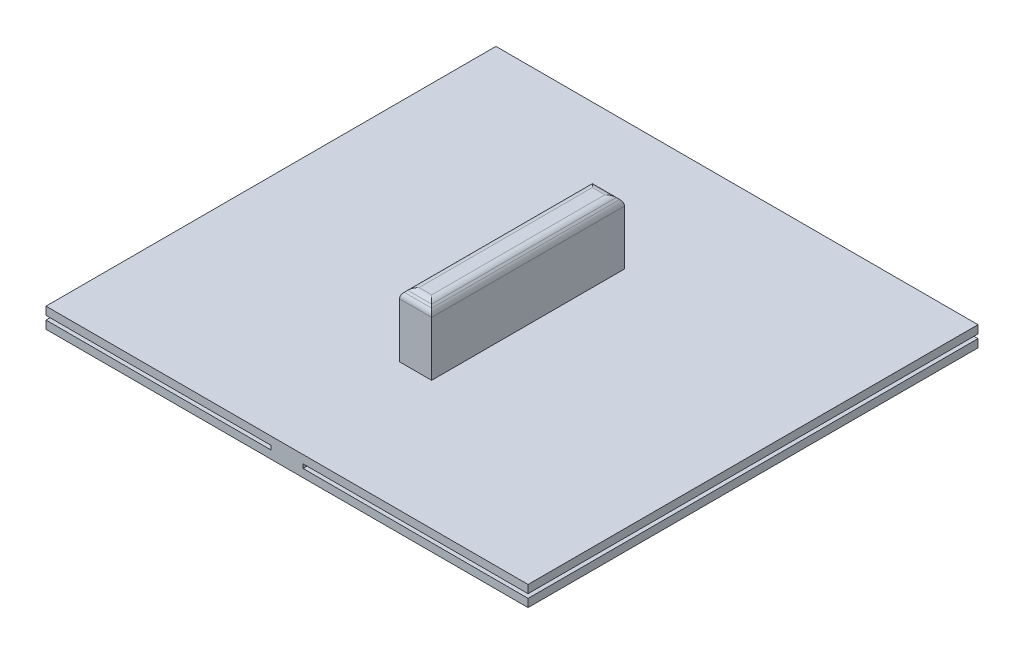
ISO-10303-21;
HEADER;
FILE_DESCRIPTION(('STEP AP214'),'2;1');
FILE_NAME('part.step','',(''),(''),'','','');
FILE_SCHEMA(('AUTOMOTIVE_DESIGN { 1 0 10303 214 1 1 1 1 }'));
ENDSEC;
DATA;
#1=APPLICATION_CONTEXT('core data for automotive mechanical design processes');
#2=APPLICATION_PROTOCOL_DEFINITION('international standard','automotive_design',2000,#1);
#3=PRODUCT_CONTEXT('',#1,'mechanical');
#4=PRODUCT('Part','Part','',(#3));
#5=PRODUCT_RELATED_PRODUCT_CATEGORY('part','',(#4));
#6=PRODUCT_DEFINITION_FORMATION('','',#4);
#7=PRODUCT_DEFINITION_CONTEXT('part definition',#1,'design');
#8=PRODUCT_DEFINITION('design','',#6,#7);
#9=PRODUCT_DEFINITION_SHAPE('','',#8);
#10=(LENGTH_UNIT() NAMED_UNIT(*) SI_UNIT(.MILLI.,.METRE.));
#11=(NAMED_UNIT(*) PLANE_ANGLE_UNIT() SI_UNIT($,.RADIAN.));
#12=(NAMED_UNIT(*) SI_UNIT($,.STERADIAN.) SOLID_ANGLE_UNIT());
#13=UNCERTAINTY_MEASURE_WITH_UNIT(LENGTH_MEASURE(1.E-05),#10,'distance_accuracy_value','');
#14=(GEOMETRIC_REPRESENTATION_CONTEXT(3) GLOBAL_UNCERTAINTY_ASSIGNED_CONTEXT((#13)) GLOBAL_UNIT_ASSIGNED_CONTEXT((#10,
#11,#12)) REPRESENTATION_CONTEXT('',''));
#15=CARTESIAN_POINT('',(0.,0.,0.));
#16=DIRECTION('',(0.,0.,1.));
#17=DIRECTION('',(1.,0.,0.));
#18=AXIS2_PLACEMENT_3D('',#15,#16,#17);
#19=CARTESIAN_POINT('',(-1.27,5.3975,-35.56));
#20=DIRECTION('',(-1.,0.,0.));
#21=DIRECTION('',(0.,-1.,0.));
#22=AXIS2_PLACEMENT_3D('',#19,#20,#21);
#23=PLANE('',#22);
#24=DIRECTION('',(0.,-1.,0.));
#25=VECTOR('',#24,1.);
#26=CARTESIAN_POINT('',(-1.27,5.3975,-10.16));
#27=LINE('',#26,#25);
#28=CARTESIAN_POINT('',(-1.27,4.62647438789308,-10.16));
#29=VERTEX_POINT('',#28);
#30=CARTESIAN_POINT('',(-1.27,0.3175,-10.16));
#31=VERTEX_POINT('',#30);
#32=EDGE_CURVE('E526',#29,#31,#27,.T.);
#33=ORIENTED_EDGE('',*,*,#32,.F.);
#34=DIRECTION('',(0.,0.,1.));
#35=VECTOR('',#34,1.);
#36=CARTESIAN_POINT('',(-1.27,4.62647438789308,-35.56));
#37=LINE('',#36,#35);
#38=CARTESIAN_POINT('',(-1.27,4.62647438789308,-25.4));
#39=VERTEX_POINT('',#38);
#40=EDGE_CURVE('E43',#29,#39,#37,.F.);
#41=ORIENTED_EDGE('',*,*,#40,.T.);
#42=DIRECTION('',(0.,1.,0.));
#43=VECTOR('',#42,1.);
#44=CARTESIAN_POINT('',(-1.27,0.3175,-25.4));
#45=LINE('',#44,#43);
#46=CARTESIAN_POINT('',(-1.27,0.3175,-25.4));
#47=VERTEX_POINT('',#46);
#48=EDGE_CURVE('E204',#47,#39,#45,.T.);
#49=ORIENTED_EDGE('',*,*,#48,.F.);
#50=DIRECTION('',(0.,0.,1.));
#51=VECTOR('',#50,1.);
#52=CARTESIAN_POINT('',(-1.27,0.3175,-35.56));
#53=LINE('',#52,#51);
#54=EDGE_CURVE('E203',#47,#31,#53,.T.);
#55=ORIENTED_EDGE('',*,*,#54,.T.);
#56=EDGE_LOOP('',(#33,#41,#49,#55));
#57=FACE_BOUND('',#56,.T.);
#58=ADVANCED_FACE('F34',(#57),#23,.T.);
#59=CARTESIAN_POINT('',(-1.27,5.3975,-35.56));
#60=DIRECTION('',(0.,1.,0.));
#61=DIRECTION('',(0.,0.,1.));
#62=AXIS2_PLACEMENT_3D('',#59,#60,#61);
#63=PLANE('',#62);
#64=DIRECTION('',(-1.,0.,0.));
#65=VECTOR('',#64,1.);
#66=CARTESIAN_POINT('',(-1.27,5.3975,-24.6289743878931));
#67=LINE('',#66,#65);
#68=CARTESIAN_POINT('',(0.49897438789308,5.3975,-24.6289743878931));
#69=VERTEX_POINT('',#68);
#70=CARTESIAN_POINT('',(-0.498974387893082,5.3975,-24.6289743878931));
#71=VERTEX_POINT('',#70);
#72=EDGE_CURVE('E234',#69,#71,#67,.T.);
#73=ORIENTED_EDGE('',*,*,#72,.T.);
#74=DIRECTION('',(0.,0.,-1.));
#75=VECTOR('',#74,1.);
#76=CARTESIAN_POINT('',(-0.498974387893082,5.3975,-35.56));
#77=LINE('',#76,#75);
#78=CARTESIAN_POINT('',(-0.498974387893082,5.3975,-10.9310256121069));
#79=VERTEX_POINT('',#78);
#80=EDGE_CURVE('E236',#71,#79,#77,.F.);
#81=ORIENTED_EDGE('',*,*,#80,.T.);
#82=DIRECTION('',(-1.,0.,0.));
#83=VECTOR('',#82,1.);
#84=CARTESIAN_POINT('',(-1.27,5.3975,-10.9310256121069));
#85=LINE('',#84,#83);
#86=CARTESIAN_POINT('',(0.49897438789308,5.3975,-10.9310256121069));
#87=VERTEX_POINT('',#86);
#88=EDGE_CURVE('E229',#79,#87,#85,.F.);
#89=ORIENTED_EDGE('',*,*,#88,.T.);
#90=DIRECTION('',(0.,0.,1.));
#91=VECTOR('',#90,1.);
#92=CARTESIAN_POINT('',(0.49897438789308,5.3975,-35.56));
#93=LINE('',#92,#91);
#94=EDGE_CURVE('E231',#87,#69,#93,.F.);
#95=ORIENTED_EDGE('',*,*,#94,.T.);
#96=EDGE_LOOP('',(#73,#81,#89,#95));
#97=FACE_BOUND('',#96,.T.);
#98=ADVANCED_FACE('F307',(#97),#63,.T.);
#99=CARTESIAN_POINT('',(1.27,0.3175,-35.56));
#100=DIRECTION('',(1.,0.,0.));
#101=DIRECTION('',(0.,1.,0.));
#102=AXIS2_PLACEMENT_3D('',#99,#100,#101);
#103=PLANE('',#102);
#104=DIRECTION('',(0.,-1.,0.));
#105=VECTOR('',#104,1.);
#106=CARTESIAN_POINT('',(1.27,0.3175,-25.4));
#107=LINE('',#106,#105);
#108=CARTESIAN_POINT('',(1.27,4.62647438789308,-25.4));
#109=VERTEX_POINT('',#108);
#110=CARTESIAN_POINT('',(1.27,0.3175,-25.4));
#111=VERTEX_POINT('',#110);
#112=EDGE_CURVE('E184',#109,#111,#107,.T.);
#113=ORIENTED_EDGE('',*,*,#112,.F.);
#114=DIRECTION('',(0.,0.,-1.));
#115=VECTOR('',#114,1.);
#116=CARTESIAN_POINT('',(1.27,4.62647438789308,-35.56));
#117=LINE('',#116,#115);
#118=CARTESIAN_POINT('',(1.27,4.62647438789308,-10.16));
#119=VERTEX_POINT('',#118);
#120=EDGE_CURVE('E11',#109,#119,#117,.F.);
#121=ORIENTED_EDGE('',*,*,#120,.T.);
#122=DIRECTION('',(0.,1.,0.));
#123=VECTOR('',#122,1.);
#124=CARTESIAN_POINT('',(1.27,5.3975,-10.16));
#125=LINE('',#124,#123);
#126=CARTESIAN_POINT('',(1.27,0.3175,-10.16));
#127=VERTEX_POINT('',#126);
#128=EDGE_CURVE('E207',#127,#119,#125,.T.);
#129=ORIENTED_EDGE('',*,*,#128,.F.);
#130=DIRECTION('',(0.,0.,1.));
#131=VECTOR('',#130,1.);
#132=CARTESIAN_POINT('',(1.27,0.3175,-35.56));
#133=LINE('',#132,#131);
#134=EDGE_CURVE('E200',#111,#127,#133,.T.);
#135=ORIENTED_EDGE('',*,*,#134,.F.);
#136=EDGE_LOOP('',(#113,#121,#129,#135));
#137=FACE_BOUND('',#136,.T.);
#138=ADVANCED_FACE('F206',(#137),#103,.T.);
#139=CARTESIAN_POINT('',(19.05,-0.3175,-35.56));
#140=DIRECTION('',(1.,0.,0.));
#141=DIRECTION('',(0.,0.,-1.));
#142=AXIS2_PLACEMENT_3D('',#139,#140,#141);
#143=PLANE('',#142);
#144=DIRECTION('',(0.,1.,0.));
#145=VECTOR('',#144,1.);
#146=CARTESIAN_POINT('',(19.05,-0.3175,0.));
#147=LINE('',#146,#145);
#148=CARTESIAN_POINT('',(19.05,-0.3175,0.));
#149=VERTEX_POINT('',#148);
#150=CARTESIAN_POINT('',(19.05,0.3175,0.));
#151=VERTEX_POINT('',#150);
#152=EDGE_CURVE('E425',#149,#151,#147,.T.);
#153=ORIENTED_EDGE('',*,*,#152,.F.);
#154=DIRECTION('',(0.,0.,1.));
#155=VECTOR('',#154,1.);
#156=CARTESIAN_POINT('',(19.05,-0.3175,-35.56));
#157=LINE('',#156,#155);
#158=CARTESIAN_POINT('',(19.05,-0.3175,-35.56));
#159=VERTEX_POINT('',#158);
#160=EDGE_CURVE('E459',#159,#149,#157,.T.);
#161=ORIENTED_EDGE('',*,*,#160,.F.);
#162=DIRECTION('',(0.,1.,0.));
#163=VECTOR('',#162,1.);
#164=CARTESIAN_POINT('',(19.05,-0.3175,-35.56));
#165=LINE('',#164,#163);
#166=CARTESIAN_POINT('',(19.05,0.3175,-35.56));
#167=VERTEX_POINT('',#166);
#168=EDGE_CURVE('E208',#159,#167,#165,.T.);
#169=ORIENTED_EDGE('',*,*,#168,.T.);
#170=DIRECTION('',(0.,0.,1.));
#171=VECTOR('',#170,1.);
#172=CARTESIAN_POINT('',(19.05,0.3175,-35.56));
#173=LINE('',#172,#171);
#174=EDGE_CURVE('E232',#167,#151,#173,.T.);
#175=ORIENTED_EDGE('',*,*,#174,.T.);
#176=EDGE_LOOP('',(#153,#161,#169,#175));
#177=FACE_BOUND('',#176,.T.);
#178=ADVANCED_FACE('F338',(#177),#143,.T.);
#179=CARTESIAN_POINT('',(1.27,-0.3175,-35.56));
#180=DIRECTION('',(0.,-1.,0.));
#181=DIRECTION('',(0.,0.,-1.));
#182=AXIS2_PLACEMENT_3D('',#179,#180,#181);
#183=PLANE('',#182);
#184=DIRECTION('',(1.,0.,0.));
#185=VECTOR('',#184,1.);
#186=CARTESIAN_POINT('',(1.27,-0.3175,0.));
#187=LINE('',#186,#185);
#188=CARTESIAN_POINT('',(1.27,-0.3175,0.));
#189=VERTEX_POINT('',#188);
#190=EDGE_CURVE('E454',#189,#149,#187,.T.);
#191=ORIENTED_EDGE('',*,*,#190,.F.);
#192=DIRECTION('',(0.,0.,1.));
#193=VECTOR('',#192,1.);
#194=CARTESIAN_POINT('',(1.27,-0.3175,-35.56));
#195=LINE('',#194,#193);
#196=CARTESIAN_POINT('',(1.27,-0.3175,-35.56));
#197=VERTEX_POINT('',#196);
#198=EDGE_CURVE('E461',#197,#189,#195,.T.);
#199=ORIENTED_EDGE('',*,*,#198,.F.);
#200=DIRECTION('',(1.,0.,0.));
#201=VECTOR('',#200,1.);
#202=CARTESIAN_POINT('',(1.27,-0.3175,-35.56));
#203=LINE('',#202,#201);
#204=EDGE_CURVE('E213',#197,#159,#203,.T.);
#205=ORIENTED_EDGE('',*,*,#204,.T.);
#206=ORIENTED_EDGE('',*,*,#160,.T.);
#207=EDGE_LOOP('',(#191,#199,#205,#206));
#208=FACE_BOUND('',#207,.T.);
#209=ADVANCED_FACE('F367',(#208),#183,.T.);
#210=CARTESIAN_POINT('',(1.27,-0.635,-35.56));
#211=DIRECTION('',(1.,0.,0.));
#212=DIRECTION('',(0.,1.,0.));
#213=AXIS2_PLACEMENT_3D('',#210,#211,#212);
#214=PLANE('',#213);
#215=DIRECTION('',(0.,1.,0.));
#216=VECTOR('',#215,1.);
#217=CARTESIAN_POINT('',(1.27,-0.635,0.));
#218=LINE('',#217,#216);
#219=CARTESIAN_POINT('',(1.27,-0.635,0.));
#220=VERTEX_POINT('',#219);
#221=EDGE_CURVE('E451',#220,#189,#218,.T.);
#222=ORIENTED_EDGE('',*,*,#221,.F.);
#223=DIRECTION('',(0.,0.,1.));
#224=VECTOR('',#223,1.);
#225=CARTESIAN_POINT('',(1.27,-0.635,-35.56));
#226=LINE('',#225,#224);
#227=CARTESIAN_POINT('',(1.27,-0.635,-35.56));
#228=VERTEX_POINT('',#227);
#229=EDGE_CURVE('E463',#228,#220,#226,.T.);
#230=ORIENTED_EDGE('',*,*,#229,.F.);
#231=DIRECTION('',(0.,1.,0.));
#232=VECTOR('',#231,1.);
#233=CARTESIAN_POINT('',(1.27,-0.635,-35.56));
#234=LINE('',#233,#232);
#235=EDGE_CURVE('E505',#228,#197,#234,.T.);
#236=ORIENTED_EDGE('',*,*,#235,.T.);
#237=ORIENTED_EDGE('',*,*,#198,.T.);
#238=EDGE_LOOP('',(#222,#230,#236,#237));
#239=FACE_BOUND('',#238,.T.);
#240=ADVANCED_FACE('F371',(#239),#214,.T.);
#241=CARTESIAN_POINT('',(1.27,-0.635,-35.56));
#242=DIRECTION('',(0.,1.,0.));
#243=DIRECTION('',(0.,0.,1.));
#244=AXIS2_PLACEMENT_3D('',#241,#242,#243);
#245=PLANE('',#244);
#246=DIRECTION('',(-1.,0.,0.));
#247=VECTOR('',#246,1.);
#248=CARTESIAN_POINT('',(1.27,-0.635,0.));
#249=LINE('',#248,#247);
#250=CARTESIAN_POINT('',(19.05,-0.635,0.));
#251=VERTEX_POINT('',#250);
#252=EDGE_CURVE('E448',#251,#220,#249,.T.);
#253=ORIENTED_EDGE('',*,*,#252,.F.);
#254=DIRECTION('',(0.,0.,1.));
#255=VECTOR('',#254,1.);
#256=CARTESIAN_POINT('',(19.05,-0.635,-35.56));
#257=LINE('',#256,#255);
#258=CARTESIAN_POINT('',(19.05,-0.635,-35.56));
#259=VERTEX_POINT('',#258);
#260=EDGE_CURVE('E465',#259,#251,#257,.T.);
#261=ORIENTED_EDGE('',*,*,#260,.F.);
#262=DIRECTION('',(-1.,0.,0.));
#263=VECTOR('',#262,1.);
#264=CARTESIAN_POINT('',(1.27,-0.635,-35.56));
#265=LINE('',#264,#263);
#266=EDGE_CURVE('E502',#259,#228,#265,.T.);
#267=ORIENTED_EDGE('',*,*,#266,.T.);
#268=ORIENTED_EDGE('',*,*,#229,.T.);
#269=EDGE_LOOP('',(#253,#261,#267,#268));
#270=FACE_BOUND('',#269,.T.);
#271=ADVANCED_FACE('F375',(#270),#245,.T.);
#272=CARTESIAN_POINT('',(19.05,-1.27,-35.56));
#273=DIRECTION('',(1.,0.,0.));
#274=DIRECTION('',(0.,0.,-1.));
#275=AXIS2_PLACEMENT_3D('',#272,#273,#274);
#276=PLANE('',#275);
#277=DIRECTION('',(0.,1.,0.));
#278=VECTOR('',#277,1.);
#279=CARTESIAN_POINT('',(19.05,-1.27,0.));
#280=LINE('',#279,#278);
#281=CARTESIAN_POINT('',(19.05,-1.27,0.));
#282=VERTEX_POINT('',#281);
#283=EDGE_CURVE('E445',#282,#251,#280,.T.);
#284=ORIENTED_EDGE('',*,*,#283,.F.);
#285=DIRECTION('',(0.,0.,1.));
#286=VECTOR('',#285,1.);
#287=CARTESIAN_POINT('',(19.05,-1.27,-35.56));
#288=LINE('',#287,#286);
#289=CARTESIAN_POINT('',(19.05,-1.27,-35.56));
#290=VERTEX_POINT('',#289);
#291=EDGE_CURVE('E467',#290,#282,#288,.T.);
#292=ORIENTED_EDGE('',*,*,#291,.F.);
#293=DIRECTION('',(0.,1.,0.));
#294=VECTOR('',#293,1.);
#295=CARTESIAN_POINT('',(19.05,-1.27,-35.56));
#296=LINE('',#295,#294);
#297=EDGE_CURVE('E499',#290,#259,#296,.T.);
#298=ORIENTED_EDGE('',*,*,#297,.T.);
#299=ORIENTED_EDGE('',*,*,#260,.T.);
#300=EDGE_LOOP('',(#284,#292,#298,#299));
#301=FACE_BOUND('',#300,.T.);
#302=ADVANCED_FACE('F379',(#301),#276,.T.);
#303=CARTESIAN_POINT('',(-19.05,-1.27,-35.56));
#304=DIRECTION('',(0.,-1.,0.));
#305=DIRECTION('',(0.,0.,-1.));
#306=AXIS2_PLACEMENT_3D('',#303,#304,#305);
#307=PLANE('',#306);
#308=DIRECTION('',(1.,0.,0.));
#309=VECTOR('',#308,1.);
#310=CARTESIAN_POINT('',(-19.05,-1.27,0.));
#311=LINE('',#310,#309);
#312=CARTESIAN_POINT('',(-19.05,-1.27,0.));
#313=VERTEX_POINT('',#312);
#314=EDGE_CURVE('E442',#313,#282,#311,.T.);
#315=ORIENTED_EDGE('',*,*,#314,.F.);
#316=DIRECTION('',(0.,0.,1.));
#317=VECTOR('',#316,1.);
#318=CARTESIAN_POINT('',(-19.05,-1.27,-35.56));
#319=LINE('',#318,#317);
#320=CARTESIAN_POINT('',(-19.05,-1.27,-35.56));
#321=VERTEX_POINT('',#320);
#322=EDGE_CURVE('E469',#321,#313,#319,.T.);
#323=ORIENTED_EDGE('',*,*,#322,.F.);
#324=DIRECTION('',(1.,0.,0.));
#325=VECTOR('',#324,1.);
#326=CARTESIAN_POINT('',(-19.05,-1.27,-35.56));
#327=LINE('',#326,#325);
#328=EDGE_CURVE('E496',#321,#290,#327,.T.);
#329=ORIENTED_EDGE('',*,*,#328,.T.);
#330=ORIENTED_EDGE('',*,*,#291,.T.);
#331=EDGE_LOOP('',(#315,#323,#329,#330));
#332=FACE_BOUND('',#331,.T.);
#333=ADVANCED_FACE('F383',(#332),#307,.T.);
#334=CARTESIAN_POINT('',(-19.05,-1.27,-35.56));
#335=DIRECTION('',(-1.,0.,0.));
#336=DIRECTION('',(0.,0.,1.));
#337=AXIS2_PLACEMENT_3D('',#334,#335,#336);
#338=PLANE('',#337);
#339=DIRECTION('',(0.,-1.,0.));
#340=VECTOR('',#339,1.);
#341=CARTESIAN_POINT('',(-19.05,-1.27,0.));
#342=LINE('',#341,#340);
#343=CARTESIAN_POINT('',(-19.05,-0.635,0.));
#344=VERTEX_POINT('',#343);
#345=EDGE_CURVE('E439',#344,#313,#342,.T.);
#346=ORIENTED_EDGE('',*,*,#345,.F.);
#347=DIRECTION('',(0.,0.,1.));
#348=VECTOR('',#347,1.);
#349=CARTESIAN_POINT('',(-19.05,-0.635,-35.56));
#350=LINE('',#349,#348);
#351=CARTESIAN_POINT('',(-19.05,-0.635,-35.56));
#352=VERTEX_POINT('',#351);
#353=EDGE_CURVE('E471',#352,#344,#350,.T.);
#354=ORIENTED_EDGE('',*,*,#353,.F.);
#355=DIRECTION('',(0.,-1.,0.));
#356=VECTOR('',#355,1.);
#357=CARTESIAN_POINT('',(-19.05,-1.27,-35.56));
#358=LINE('',#357,#356);
#359=EDGE_CURVE('E493',#352,#321,#358,.T.);
#360=ORIENTED_EDGE('',*,*,#359,.T.);
#361=ORIENTED_EDGE('',*,*,#322,.T.);
#362=EDGE_LOOP('',(#346,#354,#360,#361));
#363=FACE_BOUND('',#362,.T.);
#364=ADVANCED_FACE('F387',(#363),#338,.T.);
#365=CARTESIAN_POINT('',(-19.05,-0.635,-35.56));
#366=DIRECTION('',(0.,1.,0.));
#367=DIRECTION('',(0.,0.,1.));
#368=AXIS2_PLACEMENT_3D('',#365,#366,#367);
#369=PLANE('',#368);
#370=DIRECTION('',(-1.,0.,0.));
#371=VECTOR('',#370,1.);
#372=CARTESIAN_POINT('',(-19.05,-0.635,0.));
#373=LINE('',#372,#371);
#374=CARTESIAN_POINT('',(-1.27,-0.635,0.));
#375=VERTEX_POINT('',#374);
#376=EDGE_CURVE('E436',#375,#344,#373,.T.);
#377=ORIENTED_EDGE('',*,*,#376,.F.);
#378=DIRECTION('',(0.,0.,1.));
#379=VECTOR('',#378,1.);
#380=CARTESIAN_POINT('',(-1.27,-0.635,-35.56));
#381=LINE('',#380,#379);
#382=CARTESIAN_POINT('',(-1.27,-0.635,-35.56));
#383=VERTEX_POINT('',#382);
#384=EDGE_CURVE('E473',#383,#375,#381,.T.);
#385=ORIENTED_EDGE('',*,*,#384,.F.);
#386=DIRECTION('',(-1.,0.,0.));
#387=VECTOR('',#386,1.);
#388=CARTESIAN_POINT('',(-19.05,-0.635,-35.56));
#389=LINE('',#388,#387);
#390=EDGE_CURVE('E490',#383,#352,#389,.T.);
#391=ORIENTED_EDGE('',*,*,#390,.T.);
#392=ORIENTED_EDGE('',*,*,#353,.T.);
#393=EDGE_LOOP('',(#377,#385,#391,#392));
#394=FACE_BOUND('',#393,.T.);
#395=ADVANCED_FACE('F391',(#394),#369,.T.);
#396=CARTESIAN_POINT('',(-1.27,-0.635,-35.56));
#397=DIRECTION('',(-1.,0.,0.));
#398=DIRECTION('',(0.,-1.,0.));
#399=AXIS2_PLACEMENT_3D('',#396,#397,#398);
#400=PLANE('',#399);
#401=DIRECTION('',(0.,-1.,0.));
#402=VECTOR('',#401,1.);
#403=CARTESIAN_POINT('',(-1.27,-0.635,0.));
#404=LINE('',#403,#402);
#405=CARTESIAN_POINT('',(-1.27,-0.3175,0.));
#406=VERTEX_POINT('',#405);
#407=EDGE_CURVE('E433',#406,#375,#404,.T.);
#408=ORIENTED_EDGE('',*,*,#407,.F.);
#409=DIRECTION('',(0.,0.,1.));
#410=VECTOR('',#409,1.);
#411=CARTESIAN_POINT('',(-1.27,-0.3175,-35.56));
#412=LINE('',#411,#410);
#413=CARTESIAN_POINT('',(-1.27,-0.3175,-35.56));
#414=VERTEX_POINT('',#413);
#415=EDGE_CURVE('E475',#414,#406,#412,.T.);
#416=ORIENTED_EDGE('',*,*,#415,.F.);
#417=DIRECTION('',(0.,-1.,0.));
#418=VECTOR('',#417,1.);
#419=CARTESIAN_POINT('',(-1.27,-0.635,-35.56));
#420=LINE('',#419,#418);
#421=EDGE_CURVE('E487',#414,#383,#420,.T.);
#422=ORIENTED_EDGE('',*,*,#421,.T.);
#423=ORIENTED_EDGE('',*,*,#384,.T.);
#424=EDGE_LOOP('',(#408,#416,#422,#423));
#425=FACE_BOUND('',#424,.T.);
#426=ADVANCED_FACE('F395',(#425),#400,.T.);
#427=CARTESIAN_POINT('',(-1.27,-0.3175,-35.56));
#428=DIRECTION('',(0.,-1.,0.));
#429=DIRECTION('',(0.,0.,-1.));
#430=AXIS2_PLACEMENT_3D('',#427,#428,#429);
#431=PLANE('',#430);
#432=DIRECTION('',(1.,0.,0.));
#433=VECTOR('',#432,1.);
#434=CARTESIAN_POINT('',(-1.27,-0.3175,0.));
#435=LINE('',#434,#433);
#436=CARTESIAN_POINT('',(-19.05,-0.3175,0.));
#437=VERTEX_POINT('',#436);
#438=EDGE_CURVE('E419',#437,#406,#435,.T.);
#439=ORIENTED_EDGE('',*,*,#438,.F.);
#440=DIRECTION('',(0.,0.,1.));
#441=VECTOR('',#440,1.);
#442=CARTESIAN_POINT('',(-19.05,-0.3175,-35.56));
#443=LINE('',#442,#441);
#444=CARTESIAN_POINT('',(-19.05,-0.3175,-35.56));
#445=VERTEX_POINT('',#444);
#446=EDGE_CURVE('E416',#445,#437,#443,.T.);
#447=ORIENTED_EDGE('',*,*,#446,.F.);
#448=DIRECTION('',(1.,0.,0.));
#449=VECTOR('',#448,1.);
#450=CARTESIAN_POINT('',(-1.27,-0.3175,-35.56));
#451=LINE('',#450,#449);
#452=EDGE_CURVE('E481',#445,#414,#451,.T.);
#453=ORIENTED_EDGE('',*,*,#452,.T.);
#454=ORIENTED_EDGE('',*,*,#415,.T.);
#455=EDGE_LOOP('',(#439,#447,#453,#454));
#456=FACE_BOUND('',#455,.T.);
#457=ADVANCED_FACE('F399',(#456),#431,.T.);
#458=CARTESIAN_POINT('',(-19.05,-0.3175,-35.56));
#459=DIRECTION('',(-1.,0.,0.));
#460=DIRECTION('',(0.,0.,1.));
#461=AXIS2_PLACEMENT_3D('',#458,#459,#460);
#462=PLANE('',#461);
#463=DIRECTION('',(0.,-1.,0.));
#464=VECTOR('',#463,1.);
#465=CARTESIAN_POINT('',(-19.05,-0.3175,0.));
#466=LINE('',#465,#464);
#467=CARTESIAN_POINT('',(-19.05,0.3175,0.));
#468=VERTEX_POINT('',#467);
#469=EDGE_CURVE('E412',#468,#437,#466,.T.);
#470=ORIENTED_EDGE('',*,*,#469,.F.);
#471=DIRECTION('',(0.,0.,1.));
#472=VECTOR('',#471,1.);
#473=CARTESIAN_POINT('',(-19.05,0.3175,-35.56));
#474=LINE('',#473,#472);
#475=CARTESIAN_POINT('',(-19.05,0.3175,-35.56));
#476=VERTEX_POINT('',#475);
#477=EDGE_CURVE('E210',#476,#468,#474,.T.);
#478=ORIENTED_EDGE('',*,*,#477,.F.);
#479=DIRECTION('',(0.,-1.,0.));
#480=VECTOR('',#479,1.);
#481=CARTESIAN_POINT('',(-19.05,-0.3175,-35.56));
#482=LINE('',#481,#480);
#483=EDGE_CURVE('E479',#476,#445,#482,.T.);
#484=ORIENTED_EDGE('',*,*,#483,.T.);
#485=ORIENTED_EDGE('',*,*,#446,.T.);
#486=EDGE_LOOP('',(#470,#478,#484,#485));
#487=FACE_BOUND('',#486,.T.);
#488=ADVANCED_FACE('F402',(#487),#462,.T.);
#489=CARTESIAN_POINT('',(-1.27,0.3175,-35.56));
#490=DIRECTION('',(0.,1.,0.));
#491=DIRECTION('',(0.,0.,1.));
#492=AXIS2_PLACEMENT_3D('',#489,#490,#491);
#493=PLANE('',#492);
#494=DIRECTION('',(-1.,0.,0.));
#495=VECTOR('',#494,1.);
#496=CARTESIAN_POINT('',(1.27,0.3175,-25.4));
#497=LINE('',#496,#495);
#498=EDGE_CURVE('E188',#111,#47,#497,.T.);
#499=ORIENTED_EDGE('',*,*,#498,.F.);
#500=ORIENTED_EDGE('',*,*,#134,.T.);
#501=DIRECTION('',(1.,0.,0.));
#502=VECTOR('',#501,1.);
#503=CARTESIAN_POINT('',(-1.27,0.3175,-10.16));
#504=LINE('',#503,#502);
#505=EDGE_CURVE('E428',#31,#127,#504,.T.);
#506=ORIENTED_EDGE('',*,*,#505,.F.);
#507=ORIENTED_EDGE('',*,*,#54,.F.);
#508=EDGE_LOOP('',(#499,#500,#506,#507));
#509=FACE_BOUND('',#508,.T.);
#510=DIRECTION('',(-1.,0.,0.));
#511=VECTOR('',#510,1.);
#512=CARTESIAN_POINT('',(-1.27,0.3175,0.));
#513=LINE('',#512,#511);
#514=EDGE_CURVE('E420',#151,#468,#513,.T.);
#515=ORIENTED_EDGE('',*,*,#514,.F.);
#516=ORIENTED_EDGE('',*,*,#174,.F.);
#517=DIRECTION('',(-1.,0.,0.));
#518=VECTOR('',#517,1.);
#519=CARTESIAN_POINT('',(19.05,0.3175,-35.56));
#520=LINE('',#519,#518);
#521=EDGE_CURVE('E457',#167,#476,#520,.T.);
#522=ORIENTED_EDGE('',*,*,#521,.T.);
#523=ORIENTED_EDGE('',*,*,#477,.T.);
#524=EDGE_LOOP('',(#515,#516,#522,#523));
#525=FACE_BOUND('',#524,.T.);
#526=ADVANCED_FACE('F197',(#509,#525),#493,.T.);
#527=CARTESIAN_POINT('',(0.,0.,-35.56));
#528=DIRECTION('',(0.,0.,-1.));
#529=DIRECTION('',(-1.,0.,0.));
#530=AXIS2_PLACEMENT_3D('',#527,#528,#529);
#531=PLANE('',#530);
#532=ORIENTED_EDGE('',*,*,#483,.F.);
#533=ORIENTED_EDGE('',*,*,#521,.F.);
#534=ORIENTED_EDGE('',*,*,#168,.F.);
#535=ORIENTED_EDGE('',*,*,#204,.F.);
#536=ORIENTED_EDGE('',*,*,#235,.F.);
#537=ORIENTED_EDGE('',*,*,#266,.F.);
#538=ORIENTED_EDGE('',*,*,#297,.F.);
#539=ORIENTED_EDGE('',*,*,#328,.F.);
#540=ORIENTED_EDGE('',*,*,#359,.F.);
#541=ORIENTED_EDGE('',*,*,#390,.F.);
#542=ORIENTED_EDGE('',*,*,#421,.F.);
#543=ORIENTED_EDGE('',*,*,#452,.F.);
#544=EDGE_LOOP('',(#532,#533,#534,#535,#536,#537,#538,#539,#540,#541,#542,#543));
#545=FACE_BOUND('',#544,.T.);
#546=ADVANCED_FACE('F358',(#545),#531,.T.);
#547=CARTESIAN_POINT('',(0.,0.,0.));
#548=DIRECTION('',(0.,0.,-1.));
#549=DIRECTION('',(-1.,0.,0.));
#550=AXIS2_PLACEMENT_3D('',#547,#548,#549);
#551=PLANE('',#550);
#552=ORIENTED_EDGE('',*,*,#152,.T.);
#553=ORIENTED_EDGE('',*,*,#514,.T.);
#554=ORIENTED_EDGE('',*,*,#469,.T.);
#555=ORIENTED_EDGE('',*,*,#438,.T.);
#556=ORIENTED_EDGE('',*,*,#407,.T.);
#557=ORIENTED_EDGE('',*,*,#376,.T.);
#558=ORIENTED_EDGE('',*,*,#345,.T.);
#559=ORIENTED_EDGE('',*,*,#314,.T.);
#560=ORIENTED_EDGE('',*,*,#283,.T.);
#561=ORIENTED_EDGE('',*,*,#252,.T.);
#562=ORIENTED_EDGE('',*,*,#221,.T.);
#563=ORIENTED_EDGE('',*,*,#190,.T.);
#564=EDGE_LOOP('',(#552,#553,#554,#555,#556,#557,#558,#559,#560,#561,#562,#563));
#565=FACE_BOUND('',#564,.T.);
#566=ADVANCED_FACE('F355',(#565),#551,.F.);
#567=CARTESIAN_POINT('',(0.,0.,-10.16));
#568=DIRECTION('',(0.,0.,1.));
#569=DIRECTION('',(1.,0.,0.));
#570=AXIS2_PLACEMENT_3D('',#567,#568,#569);
#571=PLANE('',#570);
#572=ORIENTED_EDGE('',*,*,#128,.T.);
#573=DIRECTION('',(1.,0.,0.));
#574=VECTOR('',#573,1.);
#575=CARTESIAN_POINT('',(0.,4.62647438789308,-10.16));
#576=LINE('',#575,#574);
#577=EDGE_CURVE('E51',#119,#29,#576,.F.);
#578=ORIENTED_EDGE('',*,*,#577,.T.);
#579=ORIENTED_EDGE('',*,*,#32,.T.);
#580=ORIENTED_EDGE('',*,*,#505,.T.);
#581=EDGE_LOOP('',(#572,#578,#579,#580));
#582=FACE_BOUND('',#581,.T.);
#583=ADVANCED_FACE('F350',(#582),#571,.T.);
#584=CARTESIAN_POINT('',(0.,0.,-25.4));
#585=DIRECTION('',(0.,0.,1.));
#586=DIRECTION('',(1.,0.,0.));
#587=AXIS2_PLACEMENT_3D('',#584,#585,#586);
#588=PLANE('',#587);
#589=ORIENTED_EDGE('',*,*,#48,.T.);
#590=DIRECTION('',(1.,0.,0.));
#591=VECTOR('',#590,1.);
#592=CARTESIAN_POINT('',(1.27,4.62647438789308,-25.4));
#593=LINE('',#592,#591);
#594=EDGE_CURVE('E191',#39,#109,#593,.T.);
#595=ORIENTED_EDGE('',*,*,#594,.T.);
#596=ORIENTED_EDGE('',*,*,#112,.T.);
#597=ORIENTED_EDGE('',*,*,#498,.T.);
#598=EDGE_LOOP('',(#589,#595,#596,#597));
#599=FACE_BOUND('',#598,.T.);
#600=ADVANCED_FACE('F187',(#599),#588,.F.);
#601=CARTESIAN_POINT('',(-0.761999999999999,5.3975,-35.56));
#602=DIRECTION('',(0.707106781186553,-0.707106781186542,0.));
#603=DIRECTION('',(0.,0.,1.));
#604=AXIS2_PLACEMENT_3D('',#601,#602,#603);
#605=PLANE('',#604);
#606=DIRECTION('',(0.577350269189622,0.577350269189631,-0.577350269189625));
#607=VECTOR('',#606,1.);
#608=CARTESIAN_POINT('',(7.53533333333326,13.6948333333334,-18.9653333333333));
#609=LINE('',#608,#607);
#610=CARTESIAN_POINT('',(-0.947987193946541,5.21151280605346,-10.4820128060535));
#611=VERTEX_POINT('',#610);
#612=CARTESIAN_POINT('',(-1.08401280605346,5.07548719394653,-10.3459871939465));
#613=VERTEX_POINT('',#612);
#614=EDGE_CURVE('E224',#611,#613,#609,.F.);
#615=ORIENTED_EDGE('',*,*,#614,.F.);
#616=DIRECTION('',(0.,0.,1.));
#617=VECTOR('',#616,1.);
#618=CARTESIAN_POINT('',(-0.947987193946542,5.21151280605346,-35.56));
#619=LINE('',#618,#617);
#620=CARTESIAN_POINT('',(-0.947987193946542,5.21151280605346,-25.0779871939465));
#621=VERTEX_POINT('',#620);
#622=EDGE_CURVE('E241',#611,#621,#619,.F.);
#623=ORIENTED_EDGE('',*,*,#622,.T.);
#624=DIRECTION('',(-0.577350269189623,-0.577350269189631,-0.577350269189623));
#625=VECTOR('',#624,1.);
#626=CARTESIAN_POINT('',(-0.846666666666671,5.31283333333333,-24.9766666666667));
#627=LINE('',#626,#625);
#628=CARTESIAN_POINT('',(-1.08401280605346,5.07548719394653,-25.2140128060535));
#629=VERTEX_POINT('',#628);
#630=EDGE_CURVE('E193',#629,#621,#627,.F.);
#631=ORIENTED_EDGE('',*,*,#630,.F.);
#632=DIRECTION('',(0.,0.,-1.));
#633=VECTOR('',#632,1.);
#634=CARTESIAN_POINT('',(-1.08401280605346,5.07548719394653,-35.56));
#635=LINE('',#634,#633);
#636=EDGE_CURVE('E239',#629,#613,#635,.F.);
#637=ORIENTED_EDGE('',*,*,#636,.T.);
#638=EDGE_LOOP('',(#615,#623,#631,#637));
#639=FACE_BOUND('',#638,.T.);
#640=ADVANCED_FACE('F314',(#639),#605,.F.);
#641=CARTESIAN_POINT('',(0.,4.88949999999999,-25.4));
#642=DIRECTION('',(0.,0.707106781186543,-0.707106781186552));
#643=DIRECTION('',(-1.,0.,0.));
#644=AXIS2_PLACEMENT_3D('',#641,#642,#643);
#645=PLANE('',#644);
#646=ORIENTED_EDGE('',*,*,#630,.T.);
#647=DIRECTION('',(-1.,0.,0.));
#648=VECTOR('',#647,1.);
#649=CARTESIAN_POINT('',(0.,5.21151280605346,-25.0779871939465));
#650=LINE('',#649,#648);
#651=CARTESIAN_POINT('',(0.947987193946541,5.21151280605346,-25.0779871939465));
#652=VERTEX_POINT('',#651);
#653=EDGE_CURVE('E247',#621,#652,#650,.F.);
#654=ORIENTED_EDGE('',*,*,#653,.T.);
#655=DIRECTION('',(-0.577350269189623,0.577350269189631,0.577350269189623));
#656=VECTOR('',#655,1.);
#657=CARTESIAN_POINT('',(0.84666666666667,5.31283333333333,-24.9766666666667));
#658=LINE('',#657,#656);
#659=CARTESIAN_POINT('',(1.08401280605346,5.07548719394653,-25.2140128060535));
#660=VERTEX_POINT('',#659);
#661=EDGE_CURVE('E220',#660,#652,#658,.T.);
#662=ORIENTED_EDGE('',*,*,#661,.F.);
#663=DIRECTION('',(1.,0.,0.));
#664=VECTOR('',#663,1.);
#665=CARTESIAN_POINT('',(-1.27,5.07548719394653,-25.2140128060535));
#666=LINE('',#665,#664);
#667=EDGE_CURVE('E244',#660,#629,#666,.F.);
#668=ORIENTED_EDGE('',*,*,#667,.T.);
#669=EDGE_LOOP('',(#646,#654,#662,#668));
#670=FACE_BOUND('',#669,.T.);
#671=ADVANCED_FACE('F343',(#670),#645,.T.);
#672=CARTESIAN_POINT('',(0.,4.88949999999999,-10.16));
#673=DIRECTION('',(0.,-0.707106781186544,-0.707106781186551));
#674=DIRECTION('',(-1.,0.,0.));
#675=AXIS2_PLACEMENT_3D('',#672,#673,#674);
#676=PLANE('',#675);
#677=DIRECTION('',(-0.577350269189622,0.577350269189631,-0.577350269189625));
#678=VECTOR('',#677,1.);
#679=CARTESIAN_POINT('',(0.846666666666671,5.31283333333333,-10.5833333333333));
#680=LINE('',#679,#678);
#681=CARTESIAN_POINT('',(0.947987193946539,5.21151280605346,-10.4820128060535));
#682=VERTEX_POINT('',#681);
#683=CARTESIAN_POINT('',(1.08401280605346,5.07548719394653,-10.3459871939465));
#684=VERTEX_POINT('',#683);
#685=EDGE_CURVE('E217',#682,#684,#680,.F.);
#686=ORIENTED_EDGE('',*,*,#685,.F.);
#687=DIRECTION('',(1.,0.,0.));
#688=VECTOR('',#687,1.);
#689=CARTESIAN_POINT('',(0.,5.21151280605346,-10.4820128060535));
#690=LINE('',#689,#688);
#691=EDGE_CURVE('E255',#682,#611,#690,.F.);
#692=ORIENTED_EDGE('',*,*,#691,.T.);
#693=ORIENTED_EDGE('',*,*,#614,.T.);
#694=DIRECTION('',(-1.,0.,0.));
#695=VECTOR('',#694,1.);
#696=CARTESIAN_POINT('',(0.,5.07548719394653,-10.3459871939465));
#697=LINE('',#696,#695);
#698=EDGE_CURVE('E253',#613,#684,#697,.F.);
#699=ORIENTED_EDGE('',*,*,#698,.T.);
#700=EDGE_LOOP('',(#686,#692,#693,#699));
#701=FACE_BOUND('',#700,.T.);
#702=ADVANCED_FACE('F288',(#701),#676,.F.);
#703=CARTESIAN_POINT('',(1.27,4.88949999999999,-35.56));
#704=DIRECTION('',(-0.707106781186553,-0.707106781186542,0.));
#705=DIRECTION('',(0.,0.,1.));
#706=AXIS2_PLACEMENT_3D('',#703,#704,#705);
#707=PLANE('',#706);
#708=ORIENTED_EDGE('',*,*,#661,.T.);
#709=DIRECTION('',(0.,0.,-1.));
#710=VECTOR('',#709,1.);
#711=CARTESIAN_POINT('',(0.947987193946541,5.21151280605346,-35.56));
#712=LINE('',#711,#710);
#713=EDGE_CURVE('E251',#652,#682,#712,.F.);
#714=ORIENTED_EDGE('',*,*,#713,.T.);
#715=ORIENTED_EDGE('',*,*,#685,.T.);
#716=DIRECTION('',(0.,0.,1.));
#717=VECTOR('',#716,1.);
#718=CARTESIAN_POINT('',(1.08401280605346,5.07548719394653,-35.56));
#719=LINE('',#718,#717);
#720=EDGE_CURVE('E249',#684,#660,#719,.F.);
#721=ORIENTED_EDGE('',*,*,#720,.T.);
#722=EDGE_LOOP('',(#708,#714,#715,#721));
#723=FACE_BOUND('',#722,.T.);
#724=ADVANCED_FACE('F292',(#723),#707,.F.);
#725=CARTESIAN_POINT('',(0.49897438789308,4.7625,-35.56));
#726=DIRECTION('',(0.,0.,1.));
#727=DIRECTION('',(1.,0.,0.));
#728=AXIS2_PLACEMENT_3D('',#725,#726,#727);
#729=CYLINDRICAL_SURFACE('',#728,0.635);
#730=CARTESIAN_POINT('',(0.49897438789308,4.7625,-10.9310256121069));
#731=DIRECTION('',(-0.707106781186547,0.,0.707106781186547));
#732=DIRECTION('',(-0.707106781186547,0.,-0.707106781186547));
#733=AXIS2_PLACEMENT_3D('',#730,#731,#732);
#734=ELLIPSE('',#733,0.898025612106915,0.635);
#735=EDGE_CURVE('E264',#682,#87,#734,.T.);
#736=ORIENTED_EDGE('',*,*,#735,.F.);
#737=ORIENTED_EDGE('',*,*,#713,.F.);
#738=CARTESIAN_POINT('',(0.49897438789308,4.7625,-24.6289743878931));
#739=DIRECTION('',(0.707106781186547,0.,0.707106781186547));
#740=DIRECTION('',(-0.707106781186547,0.,0.707106781186547));
#741=AXIS2_PLACEMENT_3D('',#738,#739,#740);
#742=ELLIPSE('',#741,0.898025612106915,0.635);
#743=EDGE_CURVE('E221',#69,#652,#742,.F.);
#744=ORIENTED_EDGE('',*,*,#743,.F.);
#745=ORIENTED_EDGE('',*,*,#94,.F.);
#746=EDGE_LOOP('',(#736,#737,#744,#745));
#747=FACE_BOUND('',#746,.T.);
#748=ADVANCED_FACE('F297',(#747),#729,.T.);
#749=CARTESIAN_POINT('',(-1.27,4.7625,-24.6289743878931));
#750=DIRECTION('',(-1.,0.,0.));
#751=DIRECTION('',(0.,0.,1.));
#752=AXIS2_PLACEMENT_3D('',#749,#750,#751);
#753=CYLINDRICAL_SURFACE('',#752,0.635);
#754=ORIENTED_EDGE('',*,*,#743,.T.);
#755=ORIENTED_EDGE('',*,*,#653,.F.);
#756=CARTESIAN_POINT('',(-0.498974387893082,4.7625,-24.6289743878931));
#757=DIRECTION('',(-0.707106781186547,0.,0.707106781186547));
#758=DIRECTION('',(-0.707106781186547,0.,-0.707106781186547));
#759=AXIS2_PLACEMENT_3D('',#756,#757,#758);
#760=ELLIPSE('',#759,0.898025612106915,0.635);
#761=EDGE_CURVE('E262',#71,#621,#760,.T.);
#762=ORIENTED_EDGE('',*,*,#761,.F.);
#763=ORIENTED_EDGE('',*,*,#72,.F.);
#764=EDGE_LOOP('',(#754,#755,#762,#763));
#765=FACE_BOUND('',#764,.T.);
#766=ADVANCED_FACE('F303',(#765),#753,.T.);
#767=CARTESIAN_POINT('',(-1.27,4.7625,-10.9310256121069));
#768=DIRECTION('',(-1.,0.,0.));
#769=DIRECTION('',(0.,0.,1.));
#770=AXIS2_PLACEMENT_3D('',#767,#768,#769);
#771=CYLINDRICAL_SURFACE('',#770,0.635);
#772=ORIENTED_EDGE('',*,*,#735,.T.);
#773=ORIENTED_EDGE('',*,*,#88,.F.);
#774=CARTESIAN_POINT('',(-0.498974387893082,4.7625,-10.9310256121069));
#775=DIRECTION('',(-0.707106781186547,0.,-0.707106781186547));
#776=DIRECTION('',(-0.707106781186547,0.,0.707106781186547));
#777=AXIS2_PLACEMENT_3D('',#774,#775,#776);
#778=ELLIPSE('',#777,0.898025612106915,0.635);
#779=EDGE_CURVE('E260',#611,#79,#778,.T.);
#780=ORIENTED_EDGE('',*,*,#779,.F.);
#781=ORIENTED_EDGE('',*,*,#691,.F.);
#782=EDGE_LOOP('',(#772,#773,#780,#781));
#783=FACE_BOUND('',#782,.T.);
#784=ADVANCED_FACE('F310',(#783),#771,.T.);
#785=CARTESIAN_POINT('',(-0.498974387893082,4.7625,-35.56));
#786=DIRECTION('',(0.,0.,-1.));
#787=DIRECTION('',(-1.,0.,0.));
#788=AXIS2_PLACEMENT_3D('',#785,#786,#787);
#789=CYLINDRICAL_SURFACE('',#788,0.635);
#790=ORIENTED_EDGE('',*,*,#761,.T.);
#791=ORIENTED_EDGE('',*,*,#622,.F.);
#792=ORIENTED_EDGE('',*,*,#779,.T.);
#793=ORIENTED_EDGE('',*,*,#80,.F.);
#794=EDGE_LOOP('',(#790,#791,#792,#793));
#795=FACE_BOUND('',#794,.T.);
#796=ADVANCED_FACE('F317',(#795),#789,.T.);
#797=CARTESIAN_POINT('',(0.,4.62647438789308,-10.795));
#798=DIRECTION('',(1.,0.,0.));
#799=DIRECTION('',(0.,0.,-1.));
#800=AXIS2_PLACEMENT_3D('',#797,#798,#799);
#801=CYLINDRICAL_SURFACE('',#800,0.635);
#802=CARTESIAN_POINT('',(0.635,4.62647438789308,-10.795));
#803=DIRECTION('',(0.707106781186547,0.,-0.707106781186547));
#804=DIRECTION('',(-0.707106781186547,0.,-0.707106781186547));
#805=AXIS2_PLACEMENT_3D('',#802,#803,#804);
#806=ELLIPSE('',#805,0.898025612106915,0.635);
#807=EDGE_CURVE('E272',#684,#119,#806,.T.);
#808=ORIENTED_EDGE('',*,*,#807,.F.);
#809=ORIENTED_EDGE('',*,*,#698,.F.);
#810=CARTESIAN_POINT('',(-0.635000000000001,4.62647438789308,-10.795));
#811=DIRECTION('',(0.707106781186547,0.,0.707106781186547));
#812=DIRECTION('',(-0.707106781186547,0.,0.707106781186547));
#813=AXIS2_PLACEMENT_3D('',#810,#811,#812);
#814=ELLIPSE('',#813,0.898025612106915,0.635);
#815=EDGE_CURVE('E38',#29,#613,#814,.F.);
#816=ORIENTED_EDGE('',*,*,#815,.F.);
#817=ORIENTED_EDGE('',*,*,#577,.F.);
#818=EDGE_LOOP('',(#808,#809,#816,#817));
#819=FACE_BOUND('',#818,.T.);
#820=ADVANCED_FACE('F36',(#819),#801,.T.);
#821=CARTESIAN_POINT('',(-0.635000000000001,4.62647438789308,-35.56));
#822=DIRECTION('',(0.,0.,1.));
#823=DIRECTION('',(1.,0.,0.));
#824=AXIS2_PLACEMENT_3D('',#821,#822,#823);
#825=CYLINDRICAL_SURFACE('',#824,0.635);
#826=ORIENTED_EDGE('',*,*,#815,.T.);
#827=ORIENTED_EDGE('',*,*,#636,.F.);
#828=CARTESIAN_POINT('',(-0.635000000000001,4.62647438789308,-24.765));
#829=DIRECTION('',(-0.707106781186547,0.,0.707106781186547));
#830=DIRECTION('',(0.707106781186547,0.,0.707106781186547));
#831=AXIS2_PLACEMENT_3D('',#828,#829,#830);
#832=ELLIPSE('',#831,0.898025612106915,0.635);
#833=EDGE_CURVE('E271',#39,#629,#832,.F.);
#834=ORIENTED_EDGE('',*,*,#833,.F.);
#835=ORIENTED_EDGE('',*,*,#40,.F.);
#836=EDGE_LOOP('',(#826,#827,#834,#835));
#837=FACE_BOUND('',#836,.T.);
#838=ADVANCED_FACE('F282',(#837),#825,.T.);
#839=CARTESIAN_POINT('',(0.635,4.62647438789308,-35.56));
#840=DIRECTION('',(0.,0.,-1.));
#841=DIRECTION('',(-1.,0.,0.));
#842=AXIS2_PLACEMENT_3D('',#839,#840,#841);
#843=CYLINDRICAL_SURFACE('',#842,0.635);
#844=ORIENTED_EDGE('',*,*,#807,.T.);
#845=ORIENTED_EDGE('',*,*,#120,.F.);
#846=CARTESIAN_POINT('',(0.635,4.62647438789308,-24.765));
#847=DIRECTION('',(-0.707106781186547,0.,-0.707106781186547));
#848=DIRECTION('',(0.707106781186547,0.,-0.707106781186547));
#849=AXIS2_PLACEMENT_3D('',#846,#847,#848);
#850=ELLIPSE('',#849,0.898025612106915,0.635);
#851=EDGE_CURVE('E269',#660,#109,#850,.T.);
#852=ORIENTED_EDGE('',*,*,#851,.F.);
#853=ORIENTED_EDGE('',*,*,#720,.F.);
#854=EDGE_LOOP('',(#844,#845,#852,#853));
#855=FACE_BOUND('',#854,.T.);
#856=ADVANCED_FACE('F532',(#855),#843,.T.);
#857=CARTESIAN_POINT('',(0.,4.62647438789308,-24.765));
#858=DIRECTION('',(-1.,0.,0.));
#859=DIRECTION('',(0.,0.,1.));
#860=AXIS2_PLACEMENT_3D('',#857,#858,#859);
#861=CYLINDRICAL_SURFACE('',#860,0.635);
#862=ORIENTED_EDGE('',*,*,#833,.T.);
#863=ORIENTED_EDGE('',*,*,#667,.F.);
#864=ORIENTED_EDGE('',*,*,#851,.T.);
#865=ORIENTED_EDGE('',*,*,#594,.F.);
#866=EDGE_LOOP('',(#862,#863,#864,#865));
#867=FACE_BOUND('',#866,.T.);
#868=ADVANCED_FACE('F530',(#867),#861,.T.);
#869=CLOSED_SHELL('',(#58,#98,#138,#178,#209,#240,#271,#302,#333,#364,#395,#426,#457,#488,#526,
#546,#566,#583,#600,#640,#671,#702,#724,#748,#766,#784,#796,#820,#838,#856,#868));
#870=MANIFOLD_SOLID_BREP('B2',#869);
#871=ADVANCED_BREP_SHAPE_REPRESENTATION('',(#18,#870),#14);
#872=SHAPE_DEFINITION_REPRESENTATION(#9,#871);
ENDSEC;
END-ISO-10303-21;
